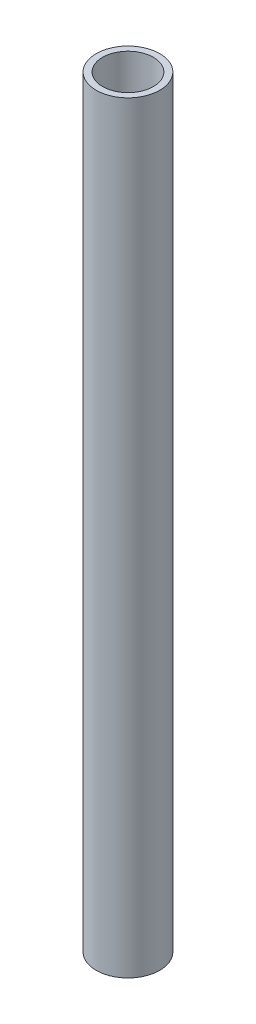
ISO-10303-21;
HEADER;
FILE_DESCRIPTION(('STEP AP214'),'2;1');
FILE_NAME('part.step','',(''),(''),'','','');
FILE_SCHEMA(('AUTOMOTIVE_DESIGN { 1 0 10303 214 1 1 1 1 }'));
ENDSEC;
DATA;
#1=APPLICATION_CONTEXT('core data for automotive mechanical design processes');
#2=APPLICATION_PROTOCOL_DEFINITION('international standard','automotive_design',2000,#1);
#3=PRODUCT_CONTEXT('',#1,'mechanical');
#4=PRODUCT('Part','Part','',(#3));
#5=PRODUCT_RELATED_PRODUCT_CATEGORY('part','',(#4));
#6=PRODUCT_DEFINITION_FORMATION('','',#4);
#7=PRODUCT_DEFINITION_CONTEXT('part definition',#1,'design');
#8=PRODUCT_DEFINITION('design','',#6,#7);
#9=PRODUCT_DEFINITION_SHAPE('','',#8);
#10=(LENGTH_UNIT() NAMED_UNIT(*) SI_UNIT(.MILLI.,.METRE.));
#11=(NAMED_UNIT(*) PLANE_ANGLE_UNIT() SI_UNIT($,.RADIAN.));
#12=(NAMED_UNIT(*) SI_UNIT($,.STERADIAN.) SOLID_ANGLE_UNIT());
#13=UNCERTAINTY_MEASURE_WITH_UNIT(LENGTH_MEASURE(1.E-05),#10,'distance_accuracy_value','');
#14=(GEOMETRIC_REPRESENTATION_CONTEXT(3) GLOBAL_UNCERTAINTY_ASSIGNED_CONTEXT((#13)) GLOBAL_UNIT_ASSIGNED_CONTEXT((#10,
#11,#12)) REPRESENTATION_CONTEXT('',''));
#15=CARTESIAN_POINT('',(0.,0.,0.));
#16=DIRECTION('',(0.,0.,1.));
#17=DIRECTION('',(1.,0.,0.));
#18=AXIS2_PLACEMENT_3D('',#15,#16,#17);
#19=CARTESIAN_POINT('',(0.,240.,0.));
#20=DIRECTION('',(0.,1.,0.));
#21=DIRECTION('',(0.,0.,1.));
#22=AXIS2_PLACEMENT_3D('',#19,#20,#21);
#23=PLANE('',#22);
#24=CARTESIAN_POINT('',(0.,240.,0.));
#25=DIRECTION('',(0.,1.,0.));
#26=DIRECTION('',(0.,0.,1.));
#27=AXIS2_PLACEMENT_3D('',#24,#25,#26);
#28=CIRCLE('',#27,10.);
#29=CARTESIAN_POINT('',(0.,240.,10.));
#30=VERTEX_POINT('',#29);
#31=EDGE_CURVE('E10',#30,#30,#28,.T.);
#32=ORIENTED_EDGE('',*,*,#31,.T.);
#33=EDGE_LOOP('',(#32));
#34=FACE_BOUND('',#33,.T.);
#35=CARTESIAN_POINT('',(0.,240.,0.));
#36=DIRECTION('',(0.,1.,0.));
#37=DIRECTION('',(0.,0.,1.));
#38=AXIS2_PLACEMENT_3D('',#35,#36,#37);
#39=CIRCLE('',#38,8.);
#40=CARTESIAN_POINT('',(0.,240.,8.));
#41=VERTEX_POINT('',#40);
#42=EDGE_CURVE('E48',#41,#41,#39,.T.);
#43=ORIENTED_EDGE('',*,*,#42,.F.);
#44=EDGE_LOOP('',(#43));
#45=FACE_BOUND('',#44,.T.);
#46=ADVANCED_FACE('F37',(#34,#45),#23,.T.);
#47=CARTESIAN_POINT('',(0.,0.,0.));
#48=DIRECTION('',(0.,1.,0.));
#49=DIRECTION('',(0.,0.,1.));
#50=AXIS2_PLACEMENT_3D('',#47,#48,#49);
#51=PLANE('',#50);
#52=CARTESIAN_POINT('',(0.,0.,0.));
#53=DIRECTION('',(0.,1.,0.));
#54=DIRECTION('',(0.,0.,1.));
#55=AXIS2_PLACEMENT_3D('',#52,#53,#54);
#56=CIRCLE('',#55,10.);
#57=CARTESIAN_POINT('',(0.,0.,10.));
#58=VERTEX_POINT('',#57);
#59=EDGE_CURVE('E41',#58,#58,#56,.T.);
#60=ORIENTED_EDGE('',*,*,#59,.F.);
#61=EDGE_LOOP('',(#60));
#62=FACE_BOUND('',#61,.T.);
#63=CARTESIAN_POINT('',(0.,0.,0.));
#64=DIRECTION('',(0.,1.,0.));
#65=DIRECTION('',(0.,0.,1.));
#66=AXIS2_PLACEMENT_3D('',#63,#64,#65);
#67=CIRCLE('',#66,8.);
#68=CARTESIAN_POINT('',(0.,0.,8.));
#69=VERTEX_POINT('',#68);
#70=EDGE_CURVE('E50',#69,#69,#67,.T.);
#71=ORIENTED_EDGE('',*,*,#70,.T.);
#72=EDGE_LOOP('',(#71));
#73=FACE_BOUND('',#72,.T.);
#74=ADVANCED_FACE('F60',(#62,#73),#51,.F.);
#75=CARTESIAN_POINT('',(0.,240.,0.));
#76=DIRECTION('',(0.,-1.,0.));
#77=DIRECTION('',(0.,0.,-1.));
#78=AXIS2_PLACEMENT_3D('',#75,#76,#77);
#79=CYLINDRICAL_SURFACE('',#78,10.);
#80=ORIENTED_EDGE('',*,*,#31,.F.);
#81=EDGE_LOOP('',(#80));
#82=FACE_BOUND('',#81,.T.);
#83=ORIENTED_EDGE('',*,*,#59,.T.);
#84=EDGE_LOOP('',(#83));
#85=FACE_BOUND('',#84,.T.);
#86=ADVANCED_FACE('F39',(#82,#85),#79,.T.);
#87=CARTESIAN_POINT('',(0.,240.,0.));
#88=DIRECTION('',(0.,-1.,0.));
#89=DIRECTION('',(0.,0.,-1.));
#90=AXIS2_PLACEMENT_3D('',#87,#88,#89);
#91=CYLINDRICAL_SURFACE('',#90,8.);
#92=ORIENTED_EDGE('',*,*,#42,.T.);
#93=EDGE_LOOP('',(#92));
#94=FACE_BOUND('',#93,.T.);
#95=ORIENTED_EDGE('',*,*,#70,.F.);
#96=EDGE_LOOP('',(#95));
#97=FACE_BOUND('',#96,.T.);
#98=ADVANCED_FACE('F56',(#94,#97),#91,.F.);
#99=CLOSED_SHELL('',(#46,#74,#86,#98));
#100=MANIFOLD_SOLID_BREP('B2',#99);
#101=ADVANCED_BREP_SHAPE_REPRESENTATION('',(#18,#100),#14);
#102=SHAPE_DEFINITION_REPRESENTATION(#9,#101);
ENDSEC;
END-ISO-10303-21;
